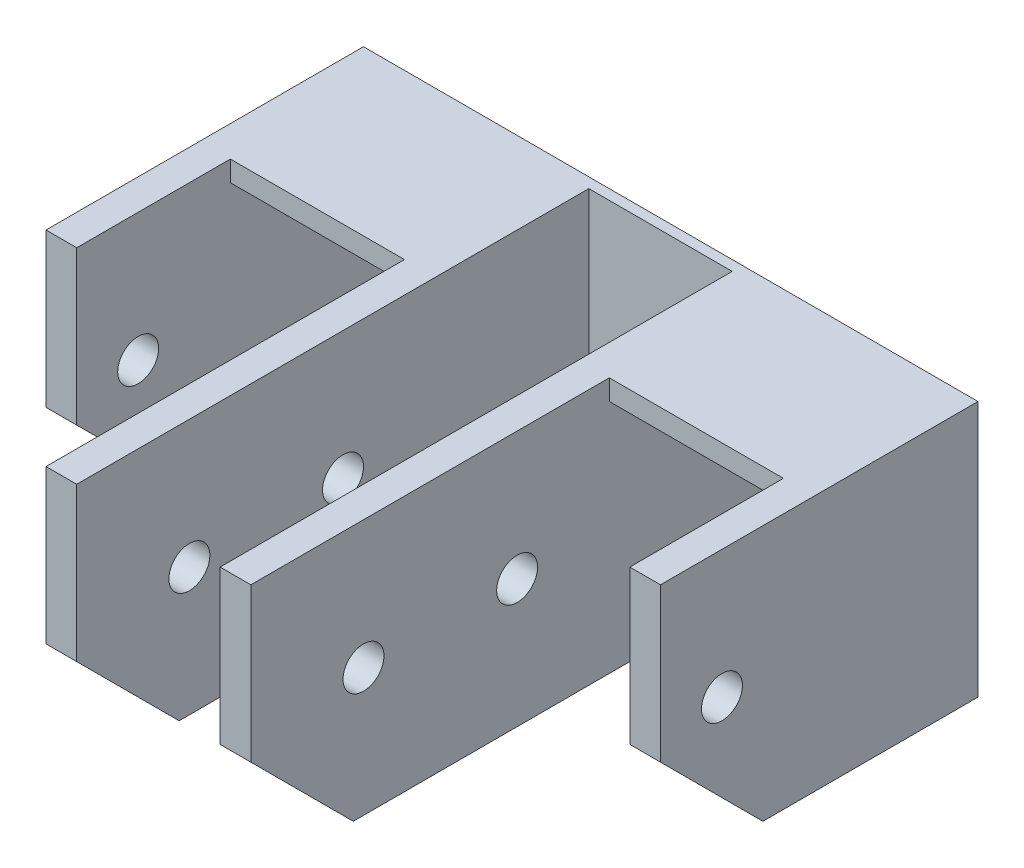
ISO-10303-21;
HEADER;
FILE_DESCRIPTION(('STEP AP214'),'2;1');
FILE_NAME('part.step','',(''),(''),'','','');
FILE_SCHEMA(('AUTOMOTIVE_DESIGN { 1 0 10303 214 1 1 1 1 }'));
ENDSEC;
DATA;
#1=APPLICATION_CONTEXT('core data for automotive mechanical design processes');
#2=APPLICATION_PROTOCOL_DEFINITION('international standard','automotive_design',2000,#1);
#3=PRODUCT_CONTEXT('',#1,'mechanical');
#4=PRODUCT('Part','Part','',(#3));
#5=PRODUCT_RELATED_PRODUCT_CATEGORY('part','',(#4));
#6=PRODUCT_DEFINITION_FORMATION('','',#4);
#7=PRODUCT_DEFINITION_CONTEXT('part definition',#1,'design');
#8=PRODUCT_DEFINITION('design','',#6,#7);
#9=PRODUCT_DEFINITION_SHAPE('','',#8);
#10=(LENGTH_UNIT() NAMED_UNIT(*) SI_UNIT(.MILLI.,.METRE.));
#11=(NAMED_UNIT(*) PLANE_ANGLE_UNIT() SI_UNIT($,.RADIAN.));
#12=(NAMED_UNIT(*) SI_UNIT($,.STERADIAN.) SOLID_ANGLE_UNIT());
#13=UNCERTAINTY_MEASURE_WITH_UNIT(LENGTH_MEASURE(1.E-05),#10,'distance_accuracy_value','');
#14=(GEOMETRIC_REPRESENTATION_CONTEXT(3) GLOBAL_UNCERTAINTY_ASSIGNED_CONTEXT((#13)) GLOBAL_UNIT_ASSIGNED_CONTEXT((#10,
#11,#12)) REPRESENTATION_CONTEXT('',''));
#15=CARTESIAN_POINT('',(0.,0.,0.));
#16=DIRECTION('',(0.,0.,1.));
#17=DIRECTION('',(1.,0.,0.));
#18=AXIS2_PLACEMENT_3D('',#15,#16,#17);
#19=CARTESIAN_POINT('',(0.,0.,51.));
#20=DIRECTION('',(0.,0.,-1.));
#21=DIRECTION('',(-1.,0.,0.));
#22=AXIS2_PLACEMENT_3D('',#19,#20,#21);
#23=PLANE('',#22);
#24=DIRECTION('',(0.,1.,0.));
#25=VECTOR('',#24,1.);
#26=CARTESIAN_POINT('',(23.,23.,51.));
#27=LINE('',#26,#25);
#28=CARTESIAN_POINT('',(23.,10.,51.));
#29=VERTEX_POINT('',#28);
#30=CARTESIAN_POINT('',(23.,25.,51.));
#31=VERTEX_POINT('',#30);
#32=EDGE_CURVE('E319',#29,#31,#27,.T.);
#33=ORIENTED_EDGE('',*,*,#32,.T.);
#34=DIRECTION('',(-1.,0.,0.));
#35=VECTOR('',#34,1.);
#36=CARTESIAN_POINT('',(0.,25.,51.));
#37=LINE('',#36,#35);
#38=CARTESIAN_POINT('',(20.,25.,51.));
#39=VERTEX_POINT('',#38);
#40=EDGE_CURVE('E325',#31,#39,#37,.T.);
#41=ORIENTED_EDGE('',*,*,#40,.T.);
#42=DIRECTION('',(0.,-1.,0.));
#43=VECTOR('',#42,1.);
#44=CARTESIAN_POINT('',(20.,0.,51.));
#45=LINE('',#44,#43);
#46=CARTESIAN_POINT('',(20.,10.,51.));
#47=VERTEX_POINT('',#46);
#48=EDGE_CURVE('E316',#39,#47,#45,.T.);
#49=ORIENTED_EDGE('',*,*,#48,.T.);
#50=DIRECTION('',(1.,0.,0.));
#51=VECTOR('',#50,1.);
#52=CARTESIAN_POINT('',(0.,10.,51.));
#53=LINE('',#52,#51);
#54=EDGE_CURVE('E388',#47,#29,#53,.T.);
#55=ORIENTED_EDGE('',*,*,#54,.T.);
#56=EDGE_LOOP('',(#33,#41,#49,#55));
#57=FACE_BOUND('',#56,.T.);
#58=ADVANCED_FACE('F34',(#57),#23,.F.);
#59=CARTESIAN_POINT('',(20.,23.,51.));
#60=DIRECTION('',(0.,1.,0.));
#61=DIRECTION('',(-1.,0.,0.));
#62=AXIS2_PLACEMENT_3D('',#59,#60,#61);
#63=PLANE('',#62);
#64=DIRECTION('',(1.,0.,0.));
#65=VECTOR('',#64,1.);
#66=CARTESIAN_POINT('',(20.,23.,16.));
#67=LINE('',#66,#65);
#68=CARTESIAN_POINT('',(3.,23.,16.));
#69=VERTEX_POINT('',#68);
#70=CARTESIAN_POINT('',(20.,23.,16.));
#71=VERTEX_POINT('',#70);
#72=EDGE_CURVE('E274',#69,#71,#67,.T.);
#73=ORIENTED_EDGE('',*,*,#72,.F.);
#74=DIRECTION('',(0.,0.,-1.));
#75=VECTOR('',#74,1.);
#76=CARTESIAN_POINT('',(3.,23.,51.));
#77=LINE('',#76,#75);
#78=CARTESIAN_POINT('',(3.,23.,1.));
#79=VERTEX_POINT('',#78);
#80=EDGE_CURVE('E360',#69,#79,#77,.T.);
#81=ORIENTED_EDGE('',*,*,#80,.T.);
#82=DIRECTION('',(1.,0.,0.));
#83=VECTOR('',#82,1.);
#84=CARTESIAN_POINT('',(20.,23.,1.));
#85=LINE('',#84,#83);
#86=CARTESIAN_POINT('',(20.,23.,1.));
#87=VERTEX_POINT('',#86);
#88=EDGE_CURVE('E331',#79,#87,#85,.T.);
#89=ORIENTED_EDGE('',*,*,#88,.T.);
#90=DIRECTION('',(0.,0.,-1.));
#91=VECTOR('',#90,1.);
#92=CARTESIAN_POINT('',(20.,23.,51.));
#93=LINE('',#92,#91);
#94=EDGE_CURVE('E358',#71,#87,#93,.T.);
#95=ORIENTED_EDGE('',*,*,#94,.F.);
#96=EDGE_LOOP('',(#73,#81,#89,#95));
#97=FACE_BOUND('',#96,.T.);
#98=ADVANCED_FACE('F488',(#97),#63,.F.);
#99=CARTESIAN_POINT('',(57.,23.,51.));
#100=DIRECTION('',(0.,1.,0.));
#101=DIRECTION('',(0.,0.,1.));
#102=AXIS2_PLACEMENT_3D('',#99,#100,#101);
#103=PLANE('',#102);
#104=DIRECTION('',(1.,0.,0.));
#105=VECTOR('',#104,1.);
#106=CARTESIAN_POINT('',(57.,23.,16.));
#107=LINE('',#106,#105);
#108=CARTESIAN_POINT('',(40.,23.,16.));
#109=VERTEX_POINT('',#108);
#110=CARTESIAN_POINT('',(57.,23.,16.));
#111=VERTEX_POINT('',#110);
#112=EDGE_CURVE('E257',#109,#111,#107,.T.);
#113=ORIENTED_EDGE('',*,*,#112,.F.);
#114=DIRECTION('',(0.,0.,-1.));
#115=VECTOR('',#114,1.);
#116=CARTESIAN_POINT('',(40.,23.,51.));
#117=LINE('',#116,#115);
#118=CARTESIAN_POINT('',(40.,23.,1.));
#119=VERTEX_POINT('',#118);
#120=EDGE_CURVE('E348',#109,#119,#117,.T.);
#121=ORIENTED_EDGE('',*,*,#120,.T.);
#122=DIRECTION('',(1.,0.,0.));
#123=VECTOR('',#122,1.);
#124=CARTESIAN_POINT('',(57.,23.,1.));
#125=LINE('',#124,#123);
#126=CARTESIAN_POINT('',(57.,23.,1.));
#127=VERTEX_POINT('',#126);
#128=EDGE_CURVE('E340',#119,#127,#125,.T.);
#129=ORIENTED_EDGE('',*,*,#128,.T.);
#130=DIRECTION('',(0.,0.,-1.));
#131=VECTOR('',#130,1.);
#132=CARTESIAN_POINT('',(57.,23.,51.));
#133=LINE('',#132,#131);
#134=EDGE_CURVE('E346',#111,#127,#133,.T.);
#135=ORIENTED_EDGE('',*,*,#134,.F.);
#136=EDGE_LOOP('',(#113,#121,#129,#135));
#137=FACE_BOUND('',#136,.T.);
#138=ADVANCED_FACE('F490',(#137),#103,.F.);
#139=CARTESIAN_POINT('',(40.,25.,51.));
#140=VERTEX_POINT('',#139);
#141=CARTESIAN_POINT('',(37.,25.,51.));
#142=VERTEX_POINT('',#141);
#143=EDGE_CURVE('E326',#140,#142,#37,.T.);
#144=ORIENTED_EDGE('',*,*,#143,.T.);
#145=DIRECTION('',(0.,-1.,0.));
#146=VECTOR('',#145,1.);
#147=CARTESIAN_POINT('',(37.,0.,51.));
#148=LINE('',#147,#146);
#149=CARTESIAN_POINT('',(37.,10.,51.));
#150=VERTEX_POINT('',#149);
#151=EDGE_CURVE('E215',#142,#150,#148,.T.);
#152=ORIENTED_EDGE('',*,*,#151,.T.);
#153=DIRECTION('',(1.,0.,0.));
#154=VECTOR('',#153,1.);
#155=CARTESIAN_POINT('',(0.,10.,51.));
#156=LINE('',#155,#154);
#157=CARTESIAN_POINT('',(40.,10.,51.));
#158=VERTEX_POINT('',#157);
#159=EDGE_CURVE('E393',#150,#158,#156,.T.);
#160=ORIENTED_EDGE('',*,*,#159,.T.);
#161=DIRECTION('',(0.,1.,0.));
#162=VECTOR('',#161,1.);
#163=CARTESIAN_POINT('',(40.,23.,51.));
#164=LINE('',#163,#162);
#165=EDGE_CURVE('E323',#158,#140,#164,.T.);
#166=ORIENTED_EDGE('',*,*,#165,.T.);
#167=EDGE_LOOP('',(#144,#152,#160,#166));
#168=FACE_BOUND('',#167,.T.);
#169=ADVANCED_FACE('F496',(#168),#23,.F.);
#170=CARTESIAN_POINT('',(0.,0.,1.));
#171=DIRECTION('',(0.,0.,-1.));
#172=DIRECTION('',(-1.,0.,0.));
#173=AXIS2_PLACEMENT_3D('',#170,#171,#172);
#174=PLANE('',#173);
#175=CARTESIAN_POINT('',(48.5,11.5,1.));
#176=DIRECTION('',(0.,0.,1.));
#177=DIRECTION('',(1.,0.,0.));
#178=AXIS2_PLACEMENT_3D('',#175,#176,#177);
#179=CIRCLE('',#178,2.5);
#180=CARTESIAN_POINT('',(51.,11.5,1.));
#181=VERTEX_POINT('',#180);
#182=EDGE_CURVE('E226',#181,#181,#179,.T.);
#183=ORIENTED_EDGE('',*,*,#182,.F.);
#184=EDGE_LOOP('',(#183));
#185=FACE_BOUND('',#184,.T.);
#186=DIRECTION('',(0.,-1.,0.));
#187=VECTOR('',#186,1.);
#188=CARTESIAN_POINT('',(57.,0.,1.));
#189=LINE('',#188,#187);
#190=CARTESIAN_POINT('',(57.,0.,1.));
#191=VERTEX_POINT('',#190);
#192=EDGE_CURVE('E320',#127,#191,#189,.T.);
#193=ORIENTED_EDGE('',*,*,#192,.F.);
#194=ORIENTED_EDGE('',*,*,#128,.F.);
#195=DIRECTION('',(0.,1.,0.));
#196=VECTOR('',#195,1.);
#197=CARTESIAN_POINT('',(40.,23.,1.));
#198=LINE('',#197,#196);
#199=CARTESIAN_POINT('',(40.,0.,1.));
#200=VERTEX_POINT('',#199);
#201=EDGE_CURVE('E208',#200,#119,#198,.T.);
#202=ORIENTED_EDGE('',*,*,#201,.F.);
#203=DIRECTION('',(1.,0.,0.));
#204=VECTOR('',#203,1.);
#205=CARTESIAN_POINT('',(0.,0.,1.));
#206=LINE('',#205,#204);
#207=EDGE_CURVE('E365',#200,#191,#206,.T.);
#208=ORIENTED_EDGE('',*,*,#207,.T.);
#209=EDGE_LOOP('',(#193,#194,#202,#208));
#210=FACE_BOUND('',#209,.T.);
#211=ADVANCED_FACE('F506',(#185,#210),#174,.F.);
#212=DIRECTION('',(0.,-1.,0.));
#213=VECTOR('',#212,1.);
#214=CARTESIAN_POINT('',(37.,0.,1.));
#215=LINE('',#214,#213);
#216=CARTESIAN_POINT('',(37.,25.,1.));
#217=VERTEX_POINT('',#216);
#218=CARTESIAN_POINT('',(37.,0.,1.));
#219=VERTEX_POINT('',#218);
#220=EDGE_CURVE('E197',#217,#219,#215,.T.);
#221=ORIENTED_EDGE('',*,*,#220,.F.);
#222=DIRECTION('',(-1.,0.,0.));
#223=VECTOR('',#222,1.);
#224=CARTESIAN_POINT('',(23.,25.,1.));
#225=LINE('',#224,#223);
#226=CARTESIAN_POINT('',(23.,25.,1.));
#227=VERTEX_POINT('',#226);
#228=EDGE_CURVE('E202',#217,#227,#225,.T.);
#229=ORIENTED_EDGE('',*,*,#228,.T.);
#230=DIRECTION('',(0.,1.,0.));
#231=VECTOR('',#230,1.);
#232=CARTESIAN_POINT('',(23.,23.,1.));
#233=LINE('',#232,#231);
#234=CARTESIAN_POINT('',(23.,0.,1.));
#235=VERTEX_POINT('',#234);
#236=EDGE_CURVE('E209',#235,#227,#233,.T.);
#237=ORIENTED_EDGE('',*,*,#236,.F.);
#238=EDGE_CURVE('E205',#235,#219,#206,.T.);
#239=ORIENTED_EDGE('',*,*,#238,.T.);
#240=EDGE_LOOP('',(#221,#229,#237,#239));
#241=FACE_BOUND('',#240,.T.);
#242=ADVANCED_FACE('F199',(#241),#174,.F.);
#243=CARTESIAN_POINT('',(11.5,11.5,1.));
#244=DIRECTION('',(0.,0.,1.));
#245=DIRECTION('',(1.,0.,0.));
#246=AXIS2_PLACEMENT_3D('',#243,#244,#245);
#247=CIRCLE('',#246,2.5);
#248=CARTESIAN_POINT('',(14.,11.5,1.));
#249=VERTEX_POINT('',#248);
#250=EDGE_CURVE('E228',#249,#249,#247,.T.);
#251=ORIENTED_EDGE('',*,*,#250,.F.);
#252=EDGE_LOOP('',(#251));
#253=FACE_BOUND('',#252,.T.);
#254=DIRECTION('',(0.,-1.,0.));
#255=VECTOR('',#254,1.);
#256=CARTESIAN_POINT('',(20.,0.,1.));
#257=LINE('',#256,#255);
#258=CARTESIAN_POINT('',(20.,0.,1.));
#259=VERTEX_POINT('',#258);
#260=EDGE_CURVE('E334',#87,#259,#257,.T.);
#261=ORIENTED_EDGE('',*,*,#260,.F.);
#262=ORIENTED_EDGE('',*,*,#88,.F.);
#263=DIRECTION('',(0.,1.,0.));
#264=VECTOR('',#263,1.);
#265=CARTESIAN_POINT('',(3.,23.,1.));
#266=LINE('',#265,#264);
#267=CARTESIAN_POINT('',(3.,0.,1.));
#268=VERTEX_POINT('',#267);
#269=EDGE_CURVE('E315',#268,#79,#266,.T.);
#270=ORIENTED_EDGE('',*,*,#269,.F.);
#271=EDGE_CURVE('E369',#268,#259,#206,.T.);
#272=ORIENTED_EDGE('',*,*,#271,.T.);
#273=EDGE_LOOP('',(#261,#262,#270,#272));
#274=FACE_BOUND('',#273,.T.);
#275=ADVANCED_FACE('F484',(#253,#274),#174,.F.);
#276=CARTESIAN_POINT('',(0.,0.,1.));
#277=DIRECTION('',(1.,0.,0.));
#278=DIRECTION('',(0.,0.,-1.));
#279=AXIS2_PLACEMENT_3D('',#276,#277,#278);
#280=PLANE('',#279);
#281=CARTESIAN_POINT('',(0.,12.5,25.));
#282=DIRECTION('',(-1.,0.,0.));
#283=DIRECTION('',(0.,0.,1.));
#284=AXIS2_PLACEMENT_3D('',#281,#282,#283);
#285=CIRCLE('',#284,2.);
#286=CARTESIAN_POINT('',(0.,12.5,27.));
#287=VERTEX_POINT('',#286);
#288=EDGE_CURVE('E264',#287,#287,#285,.T.);
#289=ORIENTED_EDGE('',*,*,#288,.F.);
#290=EDGE_LOOP('',(#289));
#291=FACE_BOUND('',#290,.T.);
#292=DIRECTION('',(0.,0.,-1.));
#293=VECTOR('',#292,1.);
#294=CARTESIAN_POINT('',(0.,0.,1.));
#295=LINE('',#294,#293);
#296=CARTESIAN_POINT('',(0.,0.,21.));
#297=VERTEX_POINT('',#296);
#298=CARTESIAN_POINT('',(0.,0.,0.));
#299=VERTEX_POINT('',#298);
#300=EDGE_CURVE('E386',#297,#299,#295,.T.);
#301=ORIENTED_EDGE('',*,*,#300,.F.);
#302=DIRECTION('',(0.,-0.707106781186549,-0.707106781186546));
#303=VECTOR('',#302,1.);
#304=CARTESIAN_POINT('',(0.,0.,21.));
#305=LINE('',#304,#303);
#306=CARTESIAN_POINT('',(0.,10.,31.));
#307=VERTEX_POINT('',#306);
#308=EDGE_CURVE('E58',#297,#307,#305,.F.);
#309=ORIENTED_EDGE('',*,*,#308,.T.);
#310=DIRECTION('',(0.,-1.,0.));
#311=VECTOR('',#310,1.);
#312=CARTESIAN_POINT('',(0.,25.,31.));
#313=LINE('',#312,#311);
#314=CARTESIAN_POINT('',(0.,25.,31.));
#315=VERTEX_POINT('',#314);
#316=EDGE_CURVE('E241',#315,#307,#313,.T.);
#317=ORIENTED_EDGE('',*,*,#316,.F.);
#318=DIRECTION('',(0.,0.,-1.));
#319=VECTOR('',#318,1.);
#320=CARTESIAN_POINT('',(0.,25.,1.));
#321=LINE('',#320,#319);
#322=CARTESIAN_POINT('',(0.,25.,0.));
#323=VERTEX_POINT('',#322);
#324=EDGE_CURVE('E380',#315,#323,#321,.T.);
#325=ORIENTED_EDGE('',*,*,#324,.T.);
#326=DIRECTION('',(0.,-1.,0.));
#327=VECTOR('',#326,1.);
#328=CARTESIAN_POINT('',(0.,0.,0.));
#329=LINE('',#328,#327);
#330=EDGE_CURVE('E364',#323,#299,#329,.T.);
#331=ORIENTED_EDGE('',*,*,#330,.T.);
#332=EDGE_LOOP('',(#301,#309,#317,#325,#331));
#333=FACE_BOUND('',#332,.T.);
#334=ADVANCED_FACE('F440',(#291,#333),#280,.F.);
#335=CARTESIAN_POINT('',(0.,0.,1.));
#336=DIRECTION('',(0.,1.,0.));
#337=DIRECTION('',(0.,0.,1.));
#338=AXIS2_PLACEMENT_3D('',#335,#336,#337);
#339=PLANE('',#338);
#340=DIRECTION('',(0.,0.,-1.));
#341=VECTOR('',#340,1.);
#342=CARTESIAN_POINT('',(40.,0.,51.));
#343=LINE('',#342,#341);
#344=CARTESIAN_POINT('',(40.,0.,41.));
#345=VERTEX_POINT('',#344);
#346=EDGE_CURVE('E350',#345,#200,#343,.T.);
#347=ORIENTED_EDGE('',*,*,#346,.F.);
#348=DIRECTION('',(-1.,0.,0.));
#349=VECTOR('',#348,1.);
#350=CARTESIAN_POINT('',(0.,0.,41.));
#351=LINE('',#350,#349);
#352=CARTESIAN_POINT('',(37.,0.,41.));
#353=VERTEX_POINT('',#352);
#354=EDGE_CURVE('E405',#345,#353,#351,.T.);
#355=ORIENTED_EDGE('',*,*,#354,.T.);
#356=DIRECTION('',(0.,0.,-1.));
#357=VECTOR('',#356,1.);
#358=CARTESIAN_POINT('',(37.,0.,51.));
#359=LINE('',#358,#357);
#360=EDGE_CURVE('E352',#353,#219,#359,.T.);
#361=ORIENTED_EDGE('',*,*,#360,.T.);
#362=ORIENTED_EDGE('',*,*,#238,.F.);
#363=DIRECTION('',(0.,0.,-1.));
#364=VECTOR('',#363,1.);
#365=CARTESIAN_POINT('',(23.,0.,51.));
#366=LINE('',#365,#364);
#367=CARTESIAN_POINT('',(23.,0.,41.));
#368=VERTEX_POINT('',#367);
#369=EDGE_CURVE('E354',#368,#235,#366,.T.);
#370=ORIENTED_EDGE('',*,*,#369,.F.);
#371=DIRECTION('',(-1.,0.,0.));
#372=VECTOR('',#371,1.);
#373=CARTESIAN_POINT('',(0.,0.,41.));
#374=LINE('',#373,#372);
#375=CARTESIAN_POINT('',(20.,0.,41.));
#376=VERTEX_POINT('',#375);
#377=EDGE_CURVE('E403',#368,#376,#374,.T.);
#378=ORIENTED_EDGE('',*,*,#377,.T.);
#379=DIRECTION('',(0.,0.,-1.));
#380=VECTOR('',#379,1.);
#381=CARTESIAN_POINT('',(20.,0.,51.));
#382=LINE('',#381,#380);
#383=EDGE_CURVE('E356',#376,#259,#382,.T.);
#384=ORIENTED_EDGE('',*,*,#383,.T.);
#385=ORIENTED_EDGE('',*,*,#271,.F.);
#386=DIRECTION('',(0.,0.,-1.));
#387=VECTOR('',#386,1.);
#388=CARTESIAN_POINT('',(3.,0.,51.));
#389=LINE('',#388,#387);
#390=CARTESIAN_POINT('',(3.,0.,21.));
#391=VERTEX_POINT('',#390);
#392=EDGE_CURVE('E362',#391,#268,#389,.T.);
#393=ORIENTED_EDGE('',*,*,#392,.F.);
#394=DIRECTION('',(-1.,0.,0.));
#395=VECTOR('',#394,1.);
#396=CARTESIAN_POINT('',(0.,0.,21.));
#397=LINE('',#396,#395);
#398=EDGE_CURVE('E398',#391,#297,#397,.T.);
#399=ORIENTED_EDGE('',*,*,#398,.T.);
#400=ORIENTED_EDGE('',*,*,#300,.T.);
#401=DIRECTION('',(1.,0.,0.));
#402=VECTOR('',#401,1.);
#403=CARTESIAN_POINT('',(0.,0.,0.));
#404=LINE('',#403,#402);
#405=CARTESIAN_POINT('',(60.,0.,0.));
#406=VERTEX_POINT('',#405);
#407=EDGE_CURVE('E372',#299,#406,#404,.T.);
#408=ORIENTED_EDGE('',*,*,#407,.T.);
#409=DIRECTION('',(0.,0.,-1.));
#410=VECTOR('',#409,1.);
#411=CARTESIAN_POINT('',(60.,0.,1.));
#412=LINE('',#411,#410);
#413=CARTESIAN_POINT('',(60.,0.,21.));
#414=VERTEX_POINT('',#413);
#415=EDGE_CURVE('E384',#414,#406,#412,.T.);
#416=ORIENTED_EDGE('',*,*,#415,.F.);
#417=DIRECTION('',(-1.,0.,0.));
#418=VECTOR('',#417,1.);
#419=CARTESIAN_POINT('',(0.,0.,21.));
#420=LINE('',#419,#418);
#421=CARTESIAN_POINT('',(57.,0.,21.));
#422=VERTEX_POINT('',#421);
#423=EDGE_CURVE('E401',#414,#422,#420,.T.);
#424=ORIENTED_EDGE('',*,*,#423,.T.);
#425=DIRECTION('',(0.,0.,-1.));
#426=VECTOR('',#425,1.);
#427=CARTESIAN_POINT('',(57.,0.,51.));
#428=LINE('',#427,#426);
#429=EDGE_CURVE('E328',#422,#191,#428,.T.);
#430=ORIENTED_EDGE('',*,*,#429,.T.);
#431=ORIENTED_EDGE('',*,*,#207,.F.);
#432=EDGE_LOOP('',(#347,#355,#361,#362,#370,#378,#384,#385,#393,#399,#400,#408,#416,#424,#430,#431));
#433=FACE_BOUND('',#432,.T.);
#434=ADVANCED_FACE('F452',(#433),#339,.F.);
#435=CARTESIAN_POINT('',(60.,0.,1.));
#436=DIRECTION('',(-1.,0.,0.));
#437=DIRECTION('',(0.,0.,1.));
#438=AXIS2_PLACEMENT_3D('',#435,#436,#437);
#439=PLANE('',#438);
#440=CARTESIAN_POINT('',(60.,12.5,25.));
#441=DIRECTION('',(-1.,0.,0.));
#442=DIRECTION('',(0.,0.,1.));
#443=AXIS2_PLACEMENT_3D('',#440,#441,#442);
#444=CIRCLE('',#443,2.);
#445=CARTESIAN_POINT('',(60.,12.5,27.));
#446=VERTEX_POINT('',#445);
#447=EDGE_CURVE('E282',#446,#446,#444,.T.);
#448=ORIENTED_EDGE('',*,*,#447,.T.);
#449=EDGE_LOOP('',(#448));
#450=FACE_BOUND('',#449,.T.);
#451=DIRECTION('',(0.,1.,0.));
#452=VECTOR('',#451,1.);
#453=CARTESIAN_POINT('',(60.,25.,31.));
#454=LINE('',#453,#452);
#455=CARTESIAN_POINT('',(60.,10.,31.));
#456=VERTEX_POINT('',#455);
#457=CARTESIAN_POINT('',(60.,25.,31.));
#458=VERTEX_POINT('',#457);
#459=EDGE_CURVE('E237',#456,#458,#454,.T.);
#460=ORIENTED_EDGE('',*,*,#459,.F.);
#461=DIRECTION('',(0.,0.707106781186546,0.707106781186549));
#462=VECTOR('',#461,1.);
#463=CARTESIAN_POINT('',(60.,10.,31.));
#464=LINE('',#463,#462);
#465=EDGE_CURVE('E416',#456,#414,#464,.F.);
#466=ORIENTED_EDGE('',*,*,#465,.T.);
#467=ORIENTED_EDGE('',*,*,#415,.T.);
#468=DIRECTION('',(0.,1.,0.));
#469=VECTOR('',#468,1.);
#470=CARTESIAN_POINT('',(60.,0.,0.));
#471=LINE('',#470,#469);
#472=CARTESIAN_POINT('',(60.,25.,0.));
#473=VERTEX_POINT('',#472);
#474=EDGE_CURVE('E375',#406,#473,#471,.T.);
#475=ORIENTED_EDGE('',*,*,#474,.T.);
#476=DIRECTION('',(0.,0.,-1.));
#477=VECTOR('',#476,1.);
#478=CARTESIAN_POINT('',(60.,25.,1.));
#479=LINE('',#478,#477);
#480=EDGE_CURVE('E382',#458,#473,#479,.T.);
#481=ORIENTED_EDGE('',*,*,#480,.F.);
#482=EDGE_LOOP('',(#460,#466,#467,#475,#481));
#483=FACE_BOUND('',#482,.T.);
#484=ADVANCED_FACE('F447',(#450,#483),#439,.F.);
#485=CARTESIAN_POINT('',(0.,25.,1.));
#486=DIRECTION('',(0.,-1.,0.));
#487=DIRECTION('',(0.,0.,-1.));
#488=AXIS2_PLACEMENT_3D('',#485,#486,#487);
#489=PLANE('',#488);
#490=ORIENTED_EDGE('',*,*,#40,.F.);
#491=DIRECTION('',(0.,0.,1.));
#492=VECTOR('',#491,1.);
#493=CARTESIAN_POINT('',(23.,25.,1.));
#494=LINE('',#493,#492);
#495=EDGE_CURVE('E219',#227,#31,#494,.T.);
#496=ORIENTED_EDGE('',*,*,#495,.F.);
#497=ORIENTED_EDGE('',*,*,#228,.F.);
#498=DIRECTION('',(0.,0.,1.));
#499=VECTOR('',#498,1.);
#500=CARTESIAN_POINT('',(37.,25.,1.));
#501=LINE('',#500,#499);
#502=EDGE_CURVE('E212',#217,#142,#501,.T.);
#503=ORIENTED_EDGE('',*,*,#502,.T.);
#504=ORIENTED_EDGE('',*,*,#143,.F.);
#505=DIRECTION('',(0.,0.,1.));
#506=VECTOR('',#505,1.);
#507=CARTESIAN_POINT('',(40.,25.,16.));
#508=LINE('',#507,#506);
#509=CARTESIAN_POINT('',(40.,25.,16.));
#510=VERTEX_POINT('',#509);
#511=EDGE_CURVE('E261',#510,#140,#508,.T.);
#512=ORIENTED_EDGE('',*,*,#511,.F.);
#513=DIRECTION('',(-1.,0.,0.));
#514=VECTOR('',#513,1.);
#515=CARTESIAN_POINT('',(57.,25.,16.));
#516=LINE('',#515,#514);
#517=CARTESIAN_POINT('',(57.,25.,16.));
#518=VERTEX_POINT('',#517);
#519=EDGE_CURVE('E251',#518,#510,#516,.T.);
#520=ORIENTED_EDGE('',*,*,#519,.F.);
#521=DIRECTION('',(0.,0.,1.));
#522=VECTOR('',#521,1.);
#523=CARTESIAN_POINT('',(57.,25.,16.));
#524=LINE('',#523,#522);
#525=CARTESIAN_POINT('',(57.,25.,31.));
#526=VERTEX_POINT('',#525);
#527=EDGE_CURVE('E260',#518,#526,#524,.T.);
#528=ORIENTED_EDGE('',*,*,#527,.T.);
#529=DIRECTION('',(1.,0.,0.));
#530=VECTOR('',#529,1.);
#531=CARTESIAN_POINT('',(57.,25.,31.));
#532=LINE('',#531,#530);
#533=EDGE_CURVE('E236',#526,#458,#532,.T.);
#534=ORIENTED_EDGE('',*,*,#533,.T.);
#535=ORIENTED_EDGE('',*,*,#480,.T.);
#536=DIRECTION('',(-1.,0.,0.));
#537=VECTOR('',#536,1.);
#538=CARTESIAN_POINT('',(0.,25.,0.));
#539=LINE('',#538,#537);
#540=EDGE_CURVE('E368',#473,#323,#539,.T.);
#541=ORIENTED_EDGE('',*,*,#540,.T.);
#542=ORIENTED_EDGE('',*,*,#324,.F.);
#543=DIRECTION('',(-1.,0.,0.));
#544=VECTOR('',#543,1.);
#545=CARTESIAN_POINT('',(3.,25.,31.));
#546=LINE('',#545,#544);
#547=CARTESIAN_POINT('',(3.,25.,31.));
#548=VERTEX_POINT('',#547);
#549=EDGE_CURVE('E244',#548,#315,#546,.T.);
#550=ORIENTED_EDGE('',*,*,#549,.F.);
#551=DIRECTION('',(0.,0.,1.));
#552=VECTOR('',#551,1.);
#553=CARTESIAN_POINT('',(3.,25.,16.));
#554=LINE('',#553,#552);
#555=CARTESIAN_POINT('',(3.,25.,16.));
#556=VERTEX_POINT('',#555);
#557=EDGE_CURVE('E252',#556,#548,#554,.T.);
#558=ORIENTED_EDGE('',*,*,#557,.F.);
#559=DIRECTION('',(-1.,0.,0.));
#560=VECTOR('',#559,1.);
#561=CARTESIAN_POINT('',(20.,25.,16.));
#562=LINE('',#561,#560);
#563=CARTESIAN_POINT('',(20.,25.,16.));
#564=VERTEX_POINT('',#563);
#565=EDGE_CURVE('E269',#564,#556,#562,.T.);
#566=ORIENTED_EDGE('',*,*,#565,.F.);
#567=DIRECTION('',(0.,0.,1.));
#568=VECTOR('',#567,1.);
#569=CARTESIAN_POINT('',(20.,25.,16.));
#570=LINE('',#569,#568);
#571=EDGE_CURVE('E277',#564,#39,#570,.T.);
#572=ORIENTED_EDGE('',*,*,#571,.T.);
#573=EDGE_LOOP('',(#490,#496,#497,#503,#504,#512,#520,#528,#534,#535,#541,#542,#550,#558,#566,#572));
#574=FACE_BOUND('',#573,.T.);
#575=ADVANCED_FACE('F222',(#574),#489,.F.);
#576=CARTESIAN_POINT('',(0.,0.,0.));
#577=DIRECTION('',(0.,0.,-1.));
#578=DIRECTION('',(-1.,0.,0.));
#579=AXIS2_PLACEMENT_3D('',#576,#577,#578);
#580=PLANE('',#579);
#581=CARTESIAN_POINT('',(11.5,11.5,0.));
#582=DIRECTION('',(0.,0.,-1.));
#583=DIRECTION('',(-1.,0.,0.));
#584=AXIS2_PLACEMENT_3D('',#581,#582,#583);
#585=CIRCLE('',#584,2.5);
#586=CARTESIAN_POINT('',(8.99999999999999,11.5,0.));
#587=VERTEX_POINT('',#586);
#588=EDGE_CURVE('E38',#587,#587,#585,.T.);
#589=ORIENTED_EDGE('',*,*,#588,.F.);
#590=EDGE_LOOP('',(#589));
#591=FACE_BOUND('',#590,.T.);
#592=CARTESIAN_POINT('',(48.5,11.5,0.));
#593=DIRECTION('',(0.,0.,-1.));
#594=DIRECTION('',(-1.,0.,0.));
#595=AXIS2_PLACEMENT_3D('',#592,#593,#594);
#596=CIRCLE('',#595,2.5);
#597=CARTESIAN_POINT('',(46.,11.5,0.));
#598=VERTEX_POINT('',#597);
#599=EDGE_CURVE('E231',#598,#598,#596,.T.);
#600=ORIENTED_EDGE('',*,*,#599,.F.);
#601=EDGE_LOOP('',(#600));
#602=FACE_BOUND('',#601,.T.);
#603=ORIENTED_EDGE('',*,*,#330,.F.);
#604=ORIENTED_EDGE('',*,*,#540,.F.);
#605=ORIENTED_EDGE('',*,*,#474,.F.);
#606=ORIENTED_EDGE('',*,*,#407,.F.);
#607=EDGE_LOOP('',(#603,#604,#605,#606));
#608=FACE_BOUND('',#607,.T.);
#609=ADVANCED_FACE('F430',(#591,#602,#608),#580,.T.);
#610=CARTESIAN_POINT('',(3.,23.,51.));
#611=DIRECTION('',(-1.,0.,0.));
#612=DIRECTION('',(0.,-1.,0.));
#613=AXIS2_PLACEMENT_3D('',#610,#611,#612);
#614=PLANE('',#613);
#615=CARTESIAN_POINT('',(3.,12.5,25.));
#616=DIRECTION('',(-1.,0.,0.));
#617=DIRECTION('',(0.,-1.,0.));
#618=AXIS2_PLACEMENT_3D('',#615,#616,#617);
#619=CIRCLE('',#618,2.);
#620=CARTESIAN_POINT('',(3.,10.5,25.));
#621=VERTEX_POINT('',#620);
#622=EDGE_CURVE('E312',#621,#621,#619,.T.);
#623=ORIENTED_EDGE('',*,*,#622,.T.);
#624=EDGE_LOOP('',(#623));
#625=FACE_BOUND('',#624,.T.);
#626=DIRECTION('',(0.,-1.,0.));
#627=VECTOR('',#626,1.);
#628=CARTESIAN_POINT('',(3.,25.,31.));
#629=LINE('',#628,#627);
#630=CARTESIAN_POINT('',(3.,10.,31.));
#631=VERTEX_POINT('',#630);
#632=EDGE_CURVE('E242',#548,#631,#629,.T.);
#633=ORIENTED_EDGE('',*,*,#632,.T.);
#634=DIRECTION('',(0.,0.707106781186549,0.707106781186546));
#635=VECTOR('',#634,1.);
#636=CARTESIAN_POINT('',(3.,0.,21.));
#637=LINE('',#636,#635);
#638=EDGE_CURVE('E11',#631,#391,#637,.F.);
#639=ORIENTED_EDGE('',*,*,#638,.T.);
#640=ORIENTED_EDGE('',*,*,#392,.T.);
#641=ORIENTED_EDGE('',*,*,#269,.T.);
#642=ORIENTED_EDGE('',*,*,#80,.F.);
#643=DIRECTION('',(0.,-1.,0.));
#644=VECTOR('',#643,1.);
#645=CARTESIAN_POINT('',(3.,23.,16.));
#646=LINE('',#645,#644);
#647=EDGE_CURVE('E272',#556,#69,#646,.T.);
#648=ORIENTED_EDGE('',*,*,#647,.F.);
#649=ORIENTED_EDGE('',*,*,#557,.T.);
#650=EDGE_LOOP('',(#633,#639,#640,#641,#642,#648,#649));
#651=FACE_BOUND('',#650,.T.);
#652=ADVANCED_FACE('F433',(#625,#651),#614,.F.);
#653=CARTESIAN_POINT('',(20.,0.,51.));
#654=DIRECTION('',(1.,0.,0.));
#655=DIRECTION('',(0.,0.,-1.));
#656=AXIS2_PLACEMENT_3D('',#653,#654,#655);
#657=PLANE('',#656);
#658=CARTESIAN_POINT('',(20.,12.5,25.));
#659=DIRECTION('',(1.,0.,0.));
#660=DIRECTION('',(0.,0.,-1.));
#661=AXIS2_PLACEMENT_3D('',#658,#659,#660);
#662=CIRCLE('',#661,2.);
#663=CARTESIAN_POINT('',(20.,12.5,23.));
#664=VERTEX_POINT('',#663);
#665=EDGE_CURVE('E309',#664,#664,#662,.T.);
#666=ORIENTED_EDGE('',*,*,#665,.T.);
#667=EDGE_LOOP('',(#666));
#668=FACE_BOUND('',#667,.T.);
#669=CARTESIAN_POINT('',(20.,12.5,40.));
#670=DIRECTION('',(1.,0.,0.));
#671=DIRECTION('',(0.,0.,-1.));
#672=AXIS2_PLACEMENT_3D('',#669,#670,#671);
#673=CIRCLE('',#672,2.);
#674=CARTESIAN_POINT('',(20.,12.5,38.));
#675=VERTEX_POINT('',#674);
#676=EDGE_CURVE('E296',#675,#675,#673,.T.);
#677=ORIENTED_EDGE('',*,*,#676,.T.);
#678=EDGE_LOOP('',(#677));
#679=FACE_BOUND('',#678,.T.);
#680=ORIENTED_EDGE('',*,*,#383,.F.);
#681=DIRECTION('',(0.,-0.707106781186546,-0.707106781186549));
#682=VECTOR('',#681,1.);
#683=CARTESIAN_POINT('',(20.,10.,51.));
#684=LINE('',#683,#682);
#685=EDGE_CURVE('E411',#376,#47,#684,.F.);
#686=ORIENTED_EDGE('',*,*,#685,.T.);
#687=ORIENTED_EDGE('',*,*,#48,.F.);
#688=ORIENTED_EDGE('',*,*,#571,.F.);
#689=DIRECTION('',(0.,1.,0.));
#690=VECTOR('',#689,1.);
#691=CARTESIAN_POINT('',(20.,23.,16.));
#692=LINE('',#691,#690);
#693=EDGE_CURVE('E247',#71,#564,#692,.T.);
#694=ORIENTED_EDGE('',*,*,#693,.F.);
#695=ORIENTED_EDGE('',*,*,#94,.T.);
#696=ORIENTED_EDGE('',*,*,#260,.T.);
#697=EDGE_LOOP('',(#680,#686,#687,#688,#694,#695,#696));
#698=FACE_BOUND('',#697,.T.);
#699=ADVANCED_FACE('F469',(#668,#679,#698),#657,.F.);
#700=CARTESIAN_POINT('',(23.,23.,51.));
#701=DIRECTION('',(-1.,0.,0.));
#702=DIRECTION('',(0.,-1.,0.));
#703=AXIS2_PLACEMENT_3D('',#700,#701,#702);
#704=PLANE('',#703);
#705=CARTESIAN_POINT('',(23.,12.5,25.));
#706=DIRECTION('',(-1.,0.,0.));
#707=DIRECTION('',(0.,-1.,0.));
#708=AXIS2_PLACEMENT_3D('',#705,#706,#707);
#709=CIRCLE('',#708,2.);
#710=CARTESIAN_POINT('',(23.,10.5,25.));
#711=VERTEX_POINT('',#710);
#712=EDGE_CURVE('E306',#711,#711,#709,.T.);
#713=ORIENTED_EDGE('',*,*,#712,.T.);
#714=EDGE_LOOP('',(#713));
#715=FACE_BOUND('',#714,.T.);
#716=CARTESIAN_POINT('',(23.,12.5,40.));
#717=DIRECTION('',(-1.,0.,0.));
#718=DIRECTION('',(0.,-1.,0.));
#719=AXIS2_PLACEMENT_3D('',#716,#717,#718);
#720=CIRCLE('',#719,2.);
#721=CARTESIAN_POINT('',(23.,10.5,40.));
#722=VERTEX_POINT('',#721);
#723=EDGE_CURVE('E293',#722,#722,#720,.T.);
#724=ORIENTED_EDGE('',*,*,#723,.T.);
#725=EDGE_LOOP('',(#724));
#726=FACE_BOUND('',#725,.T.);
#727=ORIENTED_EDGE('',*,*,#32,.F.);
#728=DIRECTION('',(0.,0.707106781186546,0.707106781186549));
#729=VECTOR('',#728,1.);
#730=CARTESIAN_POINT('',(23.,10.,51.));
#731=LINE('',#730,#729);
#732=EDGE_CURVE('E409',#29,#368,#731,.F.);
#733=ORIENTED_EDGE('',*,*,#732,.T.);
#734=ORIENTED_EDGE('',*,*,#369,.T.);
#735=ORIENTED_EDGE('',*,*,#236,.T.);
#736=ORIENTED_EDGE('',*,*,#495,.T.);
#737=EDGE_LOOP('',(#727,#733,#734,#735,#736));
#738=FACE_BOUND('',#737,.T.);
#739=ADVANCED_FACE('F481',(#715,#726,#738),#704,.F.);
#740=CARTESIAN_POINT('',(37.,0.,51.));
#741=DIRECTION('',(1.,0.,0.));
#742=DIRECTION('',(0.,0.,-1.));
#743=AXIS2_PLACEMENT_3D('',#740,#741,#742);
#744=PLANE('',#743);
#745=CARTESIAN_POINT('',(37.,12.5,25.));
#746=DIRECTION('',(1.,0.,0.));
#747=DIRECTION('',(0.,0.,-1.));
#748=AXIS2_PLACEMENT_3D('',#745,#746,#747);
#749=CIRCLE('',#748,2.);
#750=CARTESIAN_POINT('',(37.,12.5,23.));
#751=VERTEX_POINT('',#750);
#752=EDGE_CURVE('E303',#751,#751,#749,.T.);
#753=ORIENTED_EDGE('',*,*,#752,.T.);
#754=EDGE_LOOP('',(#753));
#755=FACE_BOUND('',#754,.T.);
#756=CARTESIAN_POINT('',(37.,12.5,40.));
#757=DIRECTION('',(1.,0.,0.));
#758=DIRECTION('',(0.,0.,-1.));
#759=AXIS2_PLACEMENT_3D('',#756,#757,#758);
#760=CIRCLE('',#759,2.);
#761=CARTESIAN_POINT('',(37.,12.5,38.));
#762=VERTEX_POINT('',#761);
#763=EDGE_CURVE('E290',#762,#762,#760,.T.);
#764=ORIENTED_EDGE('',*,*,#763,.T.);
#765=EDGE_LOOP('',(#764));
#766=FACE_BOUND('',#765,.T.);
#767=ORIENTED_EDGE('',*,*,#360,.F.);
#768=DIRECTION('',(0.,-0.707106781186546,-0.707106781186549));
#769=VECTOR('',#768,1.);
#770=CARTESIAN_POINT('',(37.,10.,51.));
#771=LINE('',#770,#769);
#772=EDGE_CURVE('E407',#353,#150,#771,.F.);
#773=ORIENTED_EDGE('',*,*,#772,.T.);
#774=ORIENTED_EDGE('',*,*,#151,.F.);
#775=ORIENTED_EDGE('',*,*,#502,.F.);
#776=ORIENTED_EDGE('',*,*,#220,.T.);
#777=EDGE_LOOP('',(#767,#773,#774,#775,#776));
#778=FACE_BOUND('',#777,.T.);
#779=ADVANCED_FACE('F213',(#755,#766,#778),#744,.F.);
#780=CARTESIAN_POINT('',(40.,23.,51.));
#781=DIRECTION('',(-1.,0.,0.));
#782=DIRECTION('',(0.,0.,1.));
#783=AXIS2_PLACEMENT_3D('',#780,#781,#782);
#784=PLANE('',#783);
#785=CARTESIAN_POINT('',(40.,12.5,25.));
#786=DIRECTION('',(-1.,0.,0.));
#787=DIRECTION('',(0.,0.,1.));
#788=AXIS2_PLACEMENT_3D('',#785,#786,#787);
#789=CIRCLE('',#788,2.);
#790=CARTESIAN_POINT('',(40.,12.5,27.));
#791=VERTEX_POINT('',#790);
#792=EDGE_CURVE('E300',#791,#791,#789,.T.);
#793=ORIENTED_EDGE('',*,*,#792,.T.);
#794=EDGE_LOOP('',(#793));
#795=FACE_BOUND('',#794,.T.);
#796=CARTESIAN_POINT('',(40.,12.5,40.));
#797=DIRECTION('',(-1.,0.,0.));
#798=DIRECTION('',(0.,0.,1.));
#799=AXIS2_PLACEMENT_3D('',#796,#797,#798);
#800=CIRCLE('',#799,2.);
#801=CARTESIAN_POINT('',(40.,12.5,42.));
#802=VERTEX_POINT('',#801);
#803=EDGE_CURVE('E285',#802,#802,#800,.T.);
#804=ORIENTED_EDGE('',*,*,#803,.T.);
#805=EDGE_LOOP('',(#804));
#806=FACE_BOUND('',#805,.T.);
#807=ORIENTED_EDGE('',*,*,#165,.F.);
#808=DIRECTION('',(0.,0.707106781186546,0.707106781186549));
#809=VECTOR('',#808,1.);
#810=CARTESIAN_POINT('',(40.,10.,51.));
#811=LINE('',#810,#809);
#812=EDGE_CURVE('E396',#158,#345,#811,.F.);
#813=ORIENTED_EDGE('',*,*,#812,.T.);
#814=ORIENTED_EDGE('',*,*,#346,.T.);
#815=ORIENTED_EDGE('',*,*,#201,.T.);
#816=ORIENTED_EDGE('',*,*,#120,.F.);
#817=DIRECTION('',(0.,-1.,0.));
#818=VECTOR('',#817,1.);
#819=CARTESIAN_POINT('',(40.,23.,16.));
#820=LINE('',#819,#818);
#821=EDGE_CURVE('E255',#510,#109,#820,.T.);
#822=ORIENTED_EDGE('',*,*,#821,.F.);
#823=ORIENTED_EDGE('',*,*,#511,.T.);
#824=EDGE_LOOP('',(#807,#813,#814,#815,#816,#822,#823));
#825=FACE_BOUND('',#824,.T.);
#826=ADVANCED_FACE('F558',(#795,#806,#825),#784,.F.);
#827=CARTESIAN_POINT('',(57.,0.,51.));
#828=DIRECTION('',(1.,0.,0.));
#829=DIRECTION('',(0.,0.,-1.));
#830=AXIS2_PLACEMENT_3D('',#827,#828,#829);
#831=PLANE('',#830);
#832=CARTESIAN_POINT('',(57.,12.5,25.));
#833=DIRECTION('',(1.,0.,0.));
#834=DIRECTION('',(0.,0.,-1.));
#835=AXIS2_PLACEMENT_3D('',#832,#833,#834);
#836=CIRCLE('',#835,2.);
#837=CARTESIAN_POINT('',(57.,12.5,23.));
#838=VERTEX_POINT('',#837);
#839=EDGE_CURVE('E299',#838,#838,#836,.T.);
#840=ORIENTED_EDGE('',*,*,#839,.T.);
#841=EDGE_LOOP('',(#840));
#842=FACE_BOUND('',#841,.T.);
#843=ORIENTED_EDGE('',*,*,#429,.F.);
#844=DIRECTION('',(0.,-0.707106781186546,-0.707106781186549));
#845=VECTOR('',#844,1.);
#846=CARTESIAN_POINT('',(57.,10.,31.));
#847=LINE('',#846,#845);
#848=CARTESIAN_POINT('',(57.,10.,31.));
#849=VERTEX_POINT('',#848);
#850=EDGE_CURVE('E418',#422,#849,#847,.F.);
#851=ORIENTED_EDGE('',*,*,#850,.T.);
#852=DIRECTION('',(0.,1.,0.));
#853=VECTOR('',#852,1.);
#854=CARTESIAN_POINT('',(57.,25.,31.));
#855=LINE('',#854,#853);
#856=EDGE_CURVE('E234',#849,#526,#855,.T.);
#857=ORIENTED_EDGE('',*,*,#856,.T.);
#858=ORIENTED_EDGE('',*,*,#527,.F.);
#859=DIRECTION('',(0.,1.,0.));
#860=VECTOR('',#859,1.);
#861=CARTESIAN_POINT('',(57.,23.,16.));
#862=LINE('',#861,#860);
#863=EDGE_CURVE('E248',#111,#518,#862,.T.);
#864=ORIENTED_EDGE('',*,*,#863,.F.);
#865=ORIENTED_EDGE('',*,*,#134,.T.);
#866=ORIENTED_EDGE('',*,*,#192,.T.);
#867=EDGE_LOOP('',(#843,#851,#857,#858,#864,#865,#866));
#868=FACE_BOUND('',#867,.T.);
#869=ADVANCED_FACE('F538',(#842,#868),#831,.F.);
#870=CARTESIAN_POINT('',(60.,12.5,25.));
#871=DIRECTION('',(-1.,0.,0.));
#872=DIRECTION('',(0.,0.,1.));
#873=AXIS2_PLACEMENT_3D('',#870,#871,#872);
#874=CYLINDRICAL_SURFACE('',#873,2.);
#875=ORIENTED_EDGE('',*,*,#447,.F.);
#876=EDGE_LOOP('',(#875));
#877=FACE_BOUND('',#876,.T.);
#878=ORIENTED_EDGE('',*,*,#839,.F.);
#879=EDGE_LOOP('',(#878));
#880=FACE_BOUND('',#879,.T.);
#881=ADVANCED_FACE('F566',(#877,#880),#874,.F.);
#882=CARTESIAN_POINT('',(60.,12.5,40.));
#883=DIRECTION('',(-1.,0.,0.));
#884=DIRECTION('',(0.,0.,1.));
#885=AXIS2_PLACEMENT_3D('',#882,#883,#884);
#886=CYLINDRICAL_SURFACE('',#885,2.);
#887=ORIENTED_EDGE('',*,*,#803,.F.);
#888=EDGE_LOOP('',(#887));
#889=FACE_BOUND('',#888,.T.);
#890=ORIENTED_EDGE('',*,*,#763,.F.);
#891=EDGE_LOOP('',(#890));
#892=FACE_BOUND('',#891,.T.);
#893=ADVANCED_FACE('F588',(#889,#892),#886,.F.);
#894=ORIENTED_EDGE('',*,*,#792,.F.);
#895=EDGE_LOOP('',(#894));
#896=FACE_BOUND('',#895,.T.);
#897=ORIENTED_EDGE('',*,*,#752,.F.);
#898=EDGE_LOOP('',(#897));
#899=FACE_BOUND('',#898,.T.);
#900=ADVANCED_FACE('F586',(#896,#899),#874,.F.);
#901=ORIENTED_EDGE('',*,*,#723,.F.);
#902=EDGE_LOOP('',(#901));
#903=FACE_BOUND('',#902,.T.);
#904=ORIENTED_EDGE('',*,*,#676,.F.);
#905=EDGE_LOOP('',(#904));
#906=FACE_BOUND('',#905,.T.);
#907=ADVANCED_FACE('F582',(#903,#906),#886,.F.);
#908=ORIENTED_EDGE('',*,*,#712,.F.);
#909=EDGE_LOOP('',(#908));
#910=FACE_BOUND('',#909,.T.);
#911=ORIENTED_EDGE('',*,*,#665,.F.);
#912=EDGE_LOOP('',(#911));
#913=FACE_BOUND('',#912,.T.);
#914=ADVANCED_FACE('F585',(#910,#913),#874,.F.);
#915=ORIENTED_EDGE('',*,*,#288,.T.);
#916=EDGE_LOOP('',(#915));
#917=FACE_BOUND('',#916,.T.);
#918=ORIENTED_EDGE('',*,*,#622,.F.);
#919=EDGE_LOOP('',(#918));
#920=FACE_BOUND('',#919,.T.);
#921=ADVANCED_FACE('F595',(#917,#920),#874,.F.);
#922=CARTESIAN_POINT('',(0.,0.,16.));
#923=DIRECTION('',(0.,0.,1.));
#924=DIRECTION('',(1.,0.,0.));
#925=AXIS2_PLACEMENT_3D('',#922,#923,#924);
#926=PLANE('',#925);
#927=ORIENTED_EDGE('',*,*,#693,.T.);
#928=ORIENTED_EDGE('',*,*,#565,.T.);
#929=ORIENTED_EDGE('',*,*,#647,.T.);
#930=ORIENTED_EDGE('',*,*,#72,.T.);
#931=EDGE_LOOP('',(#927,#928,#929,#930));
#932=FACE_BOUND('',#931,.T.);
#933=ADVANCED_FACE('F464',(#932),#926,.T.);
#934=CARTESIAN_POINT('',(0.,0.,16.));
#935=DIRECTION('',(0.,0.,1.));
#936=DIRECTION('',(1.,0.,0.));
#937=AXIS2_PLACEMENT_3D('',#934,#935,#936);
#938=PLANE('',#937);
#939=ORIENTED_EDGE('',*,*,#863,.T.);
#940=ORIENTED_EDGE('',*,*,#519,.T.);
#941=ORIENTED_EDGE('',*,*,#821,.T.);
#942=ORIENTED_EDGE('',*,*,#112,.T.);
#943=EDGE_LOOP('',(#939,#940,#941,#942));
#944=FACE_BOUND('',#943,.T.);
#945=ADVANCED_FACE('F543',(#944),#938,.T.);
#946=CARTESIAN_POINT('',(3.,25.,31.));
#947=DIRECTION('',(0.,0.,-1.));
#948=DIRECTION('',(-1.,0.,0.));
#949=AXIS2_PLACEMENT_3D('',#946,#947,#948);
#950=PLANE('',#949);
#951=ORIENTED_EDGE('',*,*,#316,.T.);
#952=DIRECTION('',(1.,0.,0.));
#953=VECTOR('',#952,1.);
#954=CARTESIAN_POINT('',(3.,10.,31.));
#955=LINE('',#954,#953);
#956=EDGE_CURVE('E43',#307,#631,#955,.T.);
#957=ORIENTED_EDGE('',*,*,#956,.T.);
#958=ORIENTED_EDGE('',*,*,#632,.F.);
#959=ORIENTED_EDGE('',*,*,#549,.T.);
#960=EDGE_LOOP('',(#951,#957,#958,#959));
#961=FACE_BOUND('',#960,.T.);
#962=ADVANCED_FACE('F461',(#961),#950,.F.);
#963=CARTESIAN_POINT('',(57.,25.,31.));
#964=DIRECTION('',(0.,0.,-1.));
#965=DIRECTION('',(0.,1.,0.));
#966=AXIS2_PLACEMENT_3D('',#963,#964,#965);
#967=PLANE('',#966);
#968=ORIENTED_EDGE('',*,*,#856,.F.);
#969=DIRECTION('',(1.,0.,0.));
#970=VECTOR('',#969,1.);
#971=CARTESIAN_POINT('',(57.,10.,31.));
#972=LINE('',#971,#970);
#973=EDGE_CURVE('E413',#849,#456,#972,.T.);
#974=ORIENTED_EDGE('',*,*,#973,.T.);
#975=ORIENTED_EDGE('',*,*,#459,.T.);
#976=ORIENTED_EDGE('',*,*,#533,.F.);
#977=EDGE_LOOP('',(#968,#974,#975,#976));
#978=FACE_BOUND('',#977,.T.);
#979=ADVANCED_FACE('F523',(#978),#967,.F.);
#980=CARTESIAN_POINT('',(0.,10.,51.));
#981=DIRECTION('',(0.,0.707106781186549,-0.707106781186546));
#982=DIRECTION('',(1.,0.,0.));
#983=AXIS2_PLACEMENT_3D('',#980,#981,#982);
#984=PLANE('',#983);
#985=ORIENTED_EDGE('',*,*,#772,.F.);
#986=ORIENTED_EDGE('',*,*,#354,.F.);
#987=ORIENTED_EDGE('',*,*,#812,.F.);
#988=ORIENTED_EDGE('',*,*,#159,.F.);
#989=EDGE_LOOP('',(#985,#986,#987,#988));
#990=FACE_BOUND('',#989,.T.);
#991=ADVANCED_FACE('F520',(#990),#984,.F.);
#992=CARTESIAN_POINT('',(0.,10.,51.));
#993=DIRECTION('',(0.,0.707106781186549,-0.707106781186546));
#994=DIRECTION('',(1.,0.,0.));
#995=AXIS2_PLACEMENT_3D('',#992,#993,#994);
#996=PLANE('',#995);
#997=ORIENTED_EDGE('',*,*,#685,.F.);
#998=ORIENTED_EDGE('',*,*,#377,.F.);
#999=ORIENTED_EDGE('',*,*,#732,.F.);
#1000=ORIENTED_EDGE('',*,*,#54,.F.);
#1001=EDGE_LOOP('',(#997,#998,#999,#1000));
#1002=FACE_BOUND('',#1001,.T.);
#1003=ADVANCED_FACE('F477',(#1002),#996,.F.);
#1004=CARTESIAN_POINT('',(57.,10.,31.));
#1005=DIRECTION('',(0.,0.707106781186549,-0.707106781186546));
#1006=DIRECTION('',(1.,0.,0.));
#1007=AXIS2_PLACEMENT_3D('',#1004,#1005,#1006);
#1008=PLANE('',#1007);
#1009=ORIENTED_EDGE('',*,*,#850,.F.);
#1010=ORIENTED_EDGE('',*,*,#423,.F.);
#1011=ORIENTED_EDGE('',*,*,#465,.F.);
#1012=ORIENTED_EDGE('',*,*,#973,.F.);
#1013=EDGE_LOOP('',(#1009,#1010,#1011,#1012));
#1014=FACE_BOUND('',#1013,.T.);
#1015=ADVANCED_FACE('F526',(#1014),#1008,.F.);
#1016=CARTESIAN_POINT('',(0.,0.,21.));
#1017=DIRECTION('',(0.,0.707106781186546,-0.707106781186549));
#1018=DIRECTION('',(-1.,0.,0.));
#1019=AXIS2_PLACEMENT_3D('',#1016,#1017,#1018);
#1020=PLANE('',#1019);
#1021=ORIENTED_EDGE('',*,*,#638,.F.);
#1022=ORIENTED_EDGE('',*,*,#956,.F.);
#1023=ORIENTED_EDGE('',*,*,#308,.F.);
#1024=ORIENTED_EDGE('',*,*,#398,.F.);
#1025=EDGE_LOOP('',(#1021,#1022,#1023,#1024));
#1026=FACE_BOUND('',#1025,.T.);
#1027=ADVANCED_FACE('F36',(#1026),#1020,.F.);
#1028=CARTESIAN_POINT('',(48.5,11.5,-2.));
#1029=DIRECTION('',(0.,0.,1.));
#1030=DIRECTION('',(1.,0.,0.));
#1031=AXIS2_PLACEMENT_3D('',#1028,#1029,#1030);
#1032=CYLINDRICAL_SURFACE('',#1031,2.5);
#1033=ORIENTED_EDGE('',*,*,#599,.T.);
#1034=EDGE_LOOP('',(#1033));
#1035=FACE_BOUND('',#1034,.T.);
#1036=ORIENTED_EDGE('',*,*,#182,.T.);
#1037=EDGE_LOOP('',(#1036));
#1038=FACE_BOUND('',#1037,.T.);
#1039=ADVANCED_FACE('F532',(#1035,#1038),#1032,.F.);
#1040=CARTESIAN_POINT('',(11.5,11.5,-2.));
#1041=DIRECTION('',(0.,0.,1.));
#1042=DIRECTION('',(1.,0.,0.));
#1043=AXIS2_PLACEMENT_3D('',#1040,#1041,#1042);
#1044=CYLINDRICAL_SURFACE('',#1043,2.5);
#1045=ORIENTED_EDGE('',*,*,#588,.T.);
#1046=EDGE_LOOP('',(#1045));
#1047=FACE_BOUND('',#1046,.T.);
#1048=ORIENTED_EDGE('',*,*,#250,.T.);
#1049=EDGE_LOOP('',(#1048));
#1050=FACE_BOUND('',#1049,.T.);
#1051=ADVANCED_FACE('F427',(#1047,#1050),#1044,.F.);
#1052=CLOSED_SHELL('',(#58,#98,#138,#169,#211,#242,#275,#334,#434,#484,#575,#609,#652,#699,#739,
#779,#826,#869,#881,#893,#900,#907,#914,#921,#933,#945,#962,#979,#991,#1003,#1015,#1027,#1039,#1051));
#1053=MANIFOLD_SOLID_BREP('B2',#1052);
#1054=ADVANCED_BREP_SHAPE_REPRESENTATION('',(#18,#1053),#14);
#1055=SHAPE_DEFINITION_REPRESENTATION(#9,#1054);
ENDSEC;
END-ISO-10303-21;
